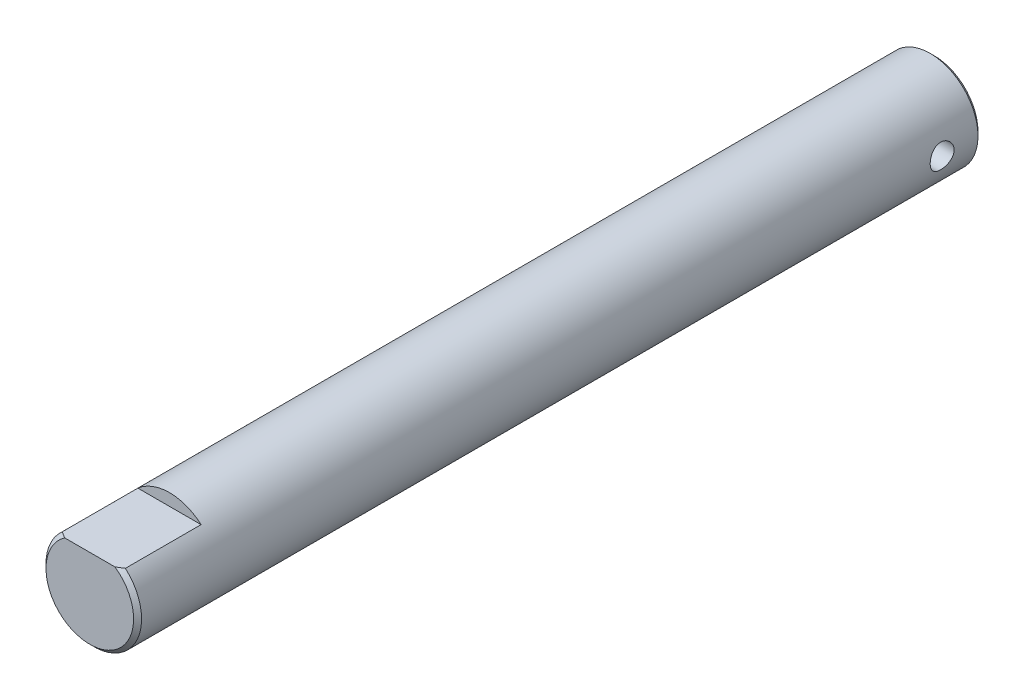
ISO-10303-21;
HEADER;
FILE_DESCRIPTION(('STEP AP214'),'2;1');
FILE_NAME('part.step','',(''),(''),'','','');
FILE_SCHEMA(('AUTOMOTIVE_DESIGN { 1 0 10303 214 1 1 1 1 }'));
ENDSEC;
DATA;
#1=APPLICATION_CONTEXT('core data for automotive mechanical design processes');
#2=APPLICATION_PROTOCOL_DEFINITION('international standard','automotive_design',2000,#1);
#3=PRODUCT_CONTEXT('',#1,'mechanical');
#4=PRODUCT('Part','Part','',(#3));
#5=PRODUCT_RELATED_PRODUCT_CATEGORY('part','',(#4));
#6=PRODUCT_DEFINITION_FORMATION('','',#4);
#7=PRODUCT_DEFINITION_CONTEXT('part definition',#1,'design');
#8=PRODUCT_DEFINITION('design','',#6,#7);
#9=PRODUCT_DEFINITION_SHAPE('','',#8);
#10=(LENGTH_UNIT() NAMED_UNIT(*) SI_UNIT(.MILLI.,.METRE.));
#11=(NAMED_UNIT(*) PLANE_ANGLE_UNIT() SI_UNIT($,.RADIAN.));
#12=(NAMED_UNIT(*) SI_UNIT($,.STERADIAN.) SOLID_ANGLE_UNIT());
#13=UNCERTAINTY_MEASURE_WITH_UNIT(LENGTH_MEASURE(1.E-05),#10,'distance_accuracy_value','');
#14=(GEOMETRIC_REPRESENTATION_CONTEXT(3) GLOBAL_UNCERTAINTY_ASSIGNED_CONTEXT((#13)) GLOBAL_UNIT_ASSIGNED_CONTEXT((#10,
#11,#12)) REPRESENTATION_CONTEXT('',''));
#15=CARTESIAN_POINT('',(0.,0.,0.));
#16=DIRECTION('',(0.,0.,1.));
#17=DIRECTION('',(1.,0.,0.));
#18=AXIS2_PLACEMENT_3D('',#15,#16,#17);
#19=CARTESIAN_POINT('',(0.,0.,106.));
#20=DIRECTION('',(0.,0.,-1.));
#21=DIRECTION('',(-1.,0.,0.));
#22=AXIS2_PLACEMENT_3D('',#19,#20,#21);
#23=CYLINDRICAL_SURFACE('',#22,6.);
#24=CARTESIAN_POINT('',(-6.,0.,3.5));
#25=CARTESIAN_POINT('',(-5.99999859868013,0.0828760886697311,3.50000232573816));
#26=CARTESIAN_POINT('',(-5.99826578131828,0.165778157830763,3.50689155077379));
#27=CARTESIAN_POINT('',(-5.99152113829892,0.329206323770532,3.53422515130701));
#28=CARTESIAN_POINT('',(-5.98650745419968,0.409731046870739,3.55467720953785));
#29=CARTESIAN_POINT('',(-5.9737562633204,0.566020872182577,3.60843925346209));
#30=CARTESIAN_POINT('',(-5.96602202842087,0.641791563430003,3.64173379871528));
#31=CARTESIAN_POINT('',(-5.94865343807593,0.786672131904426,3.72018139004483));
#32=CARTESIAN_POINT('',(-5.9390190185405,0.855781784348759,3.76533483611894));
#33=CARTESIAN_POINT('',(-5.91867413591801,0.986801927300919,3.86720078965421));
#34=CARTESIAN_POINT('',(-5.90794707148533,1.04855569006107,3.92411157495918));
#35=CARTESIAN_POINT('',(-5.8867362011753,1.1617489272033,4.04745220490892));
#36=CARTESIAN_POINT('',(-5.87625242288348,1.21318723694913,4.1138831229465));
#37=CARTESIAN_POINT('',(-5.8565477569971,1.30502654279903,4.25559522673744));
#38=CARTESIAN_POINT('',(-5.84734794470605,1.34525221592536,4.3309932308104));
#39=CARTESIAN_POINT('',(-5.83149494812223,1.41239690855053,4.48774841165836));
#40=CARTESIAN_POINT('',(-5.82484135672789,1.43931805543933,4.56910463332576));
#41=CARTESIAN_POINT('',(-5.81500476717551,1.47855483680429,4.73374349820247));
#42=CARTESIAN_POINT('',(-5.81175491075426,1.49115226833334,4.8169548960498));
#43=CARTESIAN_POINT('',(-5.80889362537741,1.50226177506785,4.98436856901398));
#44=CARTESIAN_POINT('',(-5.80928160448644,1.50077614181798,5.06857068069861));
#45=CARTESIAN_POINT('',(-5.81359205496618,1.48398652463928,5.23341580774448));
#46=CARTESIAN_POINT('',(-5.81742863001879,1.46901834019052,5.3140956214651));
#47=CARTESIAN_POINT('',(-5.82806709676484,1.42622418690311,5.47176105091129));
#48=CARTESIAN_POINT('',(-5.83486919970697,1.39839730206942,5.54874640302898));
#49=CARTESIAN_POINT('',(-5.85075113904187,1.33038947793715,5.69773801625207));
#50=CARTESIAN_POINT('',(-5.85985327469421,1.29008666723291,5.76968617178955));
#51=CARTESIAN_POINT('',(-5.87929710846386,1.19835627601495,5.90591870975684));
#52=CARTESIAN_POINT('',(-5.88963902334735,1.14692674880884,5.97020174806725));
#53=CARTESIAN_POINT('',(-5.91075880539781,1.03266342468122,6.0912036156944));
#54=CARTESIAN_POINT('',(-5.92154069477971,0.96954625816586,6.14765449006135));
#55=CARTESIAN_POINT('',(-5.94205965578786,0.8346119175037,6.2492212424639));
#56=CARTESIAN_POINT('',(-5.95179669549415,0.762794477707944,6.29433677426356));
#57=CARTESIAN_POINT('',(-5.96917732094183,0.612115888681392,6.37205058622438));
#58=CARTESIAN_POINT('',(-5.97681360127725,0.533231393208623,6.40460534025443));
#59=CARTESIAN_POINT('',(-5.98907916991419,0.370876008142883,6.45591730570957));
#60=CARTESIAN_POINT('',(-5.99370903339281,0.287405999150485,6.47467715641814));
#61=CARTESIAN_POINT('',(-5.99935499271375,0.120539970390027,6.49745756555884));
#62=CARTESIAN_POINT('',(-6.00046053508279,0.0371967199882104,6.5018430260753));
#63=CARTESIAN_POINT('',(-5.99918804814451,-0.129032874801507,6.49675099794451));
#64=CARTESIAN_POINT('',(-5.99681033241847,-0.211919259644595,6.48727475720087));
#65=CARTESIAN_POINT('',(-5.98889581127357,-0.373614268776491,6.45502909160862));
#66=CARTESIAN_POINT('',(-5.98340634185811,-0.452465118968754,6.43245873652301));
#67=CARTESIAN_POINT('',(-5.96988706634134,-0.605257292452511,6.37489291597155));
#68=CARTESIAN_POINT('',(-5.96185700369892,-0.679198119032634,6.33989619568683));
#69=CARTESIAN_POINT('',(-5.94393307926311,-0.821523134429846,6.25776387112527));
#70=CARTESIAN_POINT('',(-5.93400867366932,-0.889785441835829,6.21042388760324));
#71=CARTESIAN_POINT('',(-5.91344509187419,-1.01752661364324,6.10521009120303));
#72=CARTESIAN_POINT('',(-5.90280579251705,-1.07700395897301,6.04733446038309));
#73=CARTESIAN_POINT('',(-5.88168956960771,-1.18699056807273,5.92099803915554));
#74=CARTESIAN_POINT('',(-5.87122304187281,-1.23724386762203,5.85231229699758));
#75=CARTESIAN_POINT('',(-5.85192878377239,-1.3255107590127,5.70726736553428));
#76=CARTESIAN_POINT('',(-5.84310098067026,-1.36352489415794,5.63090851704025));
#77=CARTESIAN_POINT('',(-5.82818094734665,-1.42595142060929,5.47309427758692));
#78=CARTESIAN_POINT('',(-5.82207255291906,-1.45044439665406,5.39167237165599));
#79=CARTESIAN_POINT('',(-5.81326744090184,-1.48534565995378,5.22569036211089));
#80=CARTESIAN_POINT('',(-5.81056997719936,-1.49575702747866,5.14113094896751));
#81=CARTESIAN_POINT('',(-5.80894901203957,-1.50203859033399,4.9738789761448));
#82=CARTESIAN_POINT('',(-5.80991932728264,-1.49831789778012,4.89120256487527));
#83=CARTESIAN_POINT('',(-5.81527909007843,-1.47737727831287,4.72769611133202));
#84=CARTESIAN_POINT('',(-5.81966846891857,-1.46015762268677,4.64686603198635));
#85=CARTESIAN_POINT('',(-5.83131260682723,-1.41293131944279,4.48979154093459));
#86=CARTESIAN_POINT('',(-5.8385501523631,-1.38300140468038,4.41352269475979));
#87=CARTESIAN_POINT('',(-5.85507755724829,-1.31126491360507,4.26703461728631));
#88=CARTESIAN_POINT('',(-5.86436770120773,-1.26945669003419,4.19681622681308));
#89=CARTESIAN_POINT('',(-5.88425634263512,-1.17386774863714,4.06244537099798));
#90=CARTESIAN_POINT('',(-5.89488264831757,-1.11980316291225,3.99849892657604));
#91=CARTESIAN_POINT('',(-5.91608027246286,-1.00178937118974,3.88045295520459));
#92=CARTESIAN_POINT('',(-5.9266515772706,-0.937837821261145,3.82635576988703));
#93=CARTESIAN_POINT('',(-5.94677655647663,-0.80046758670259,3.72858869143539));
#94=CARTESIAN_POINT('',(-5.95630833365868,-0.726898422316387,3.68512538632842));
#95=CARTESIAN_POINT('',(-5.97304924975118,-0.573266059510477,3.61125253705947));
#96=CARTESIAN_POINT('',(-5.98026005199781,-0.49320756343674,3.58083363935146));
#97=CARTESIAN_POINT('',(-5.99048059565542,-0.344410253243472,3.53842816967035));
#98=CARTESIAN_POINT('',(-5.99402585052691,-0.276380170908068,3.52404875694657));
#99=CARTESIAN_POINT('',(-5.99878605231948,-0.138906071536283,3.50483405637806));
#100=CARTESIAN_POINT('',(-6.00000117450894,-0.0694621612426163,3.4999980506947));
#101=CARTESIAN_POINT('',(-6.,0.,3.5));
#102=B_SPLINE_CURVE_WITH_KNOTS('',3,(#24,#25,#26,#27,#28,#29,#30,#31,#32,#33,#34,#35,#36,#37,
#38,#39,#40,#41,#42,#43,#44,#45,#46,#47,#48,#49,#50,#51,#52,#53,#54,#55,#56,#57,#58,#59,#60,#61,
#62,#63,#64,#65,#66,#67,#68,#69,#70,#71,#72,#73,#74,#75,#76,#77,#78,#79,#80,#81,#82,#83,#84,#85,
#86,#87,#88,#89,#90,#91,#92,#93,#94,#95,#96,#97,#98,#99,#100,#101),.UNSPECIFIED.,.T.,.F.,(4,2,2,
2,2,2,2,2,2,2,2,2,2,2,2,2,2,2,2,2,2,2,2,2,2,2,2,2,2,2,2,2,2,2,2,2,2,2,4),(0.,0.24837371247189,
0.496888237763899,0.745104902286106,0.993329940169328,1.24614435437139,1.49898729580062,
1.75558647545807,2.01214461169368,2.2635629509943,2.51494038112697,2.76022497007018,
3.00552703466038,3.25330527873879,3.50112690836162,3.75601500969019,4.01091089558247,
4.26668229009114,4.52240473688642,4.77158308949276,5.02073901112743,5.26620274514037,
5.5116912732229,5.76153587565352,6.01142363008019,6.26744509204476,6.52345518749508,
6.77792254614036,7.03233423252407,7.27943780398612,7.52653640956034,7.77216400559447,
8.01782568136901,8.2698957640991,8.52202569770417,8.77872185499587,9.0352336382135,
9.24342242942149,9.45159556043039),.UNSPECIFIED.);
#103=CARTESIAN_POINT('',(-6.,0.,3.5));
#104=VERTEX_POINT('',#103);
#105=EDGE_CURVE('E11',#104,#104,#102,.T.);
#106=ORIENTED_EDGE('',*,*,#105,.T.);
#107=EDGE_LOOP('',(#106));
#108=FACE_BOUND('',#107,.T.);
#109=CARTESIAN_POINT('',(6.,0.,3.5));
#110=CARTESIAN_POINT('',(5.99999859868012,-0.0828760886697311,3.50000232573816));
#111=CARTESIAN_POINT('',(5.99826578131828,-0.165778157830763,3.50689155077379));
#112=CARTESIAN_POINT('',(5.99152113829892,-0.329206323770533,3.53422515130701));
#113=CARTESIAN_POINT('',(5.98650745419968,-0.409731046870739,3.55467720953785));
#114=CARTESIAN_POINT('',(5.9737562633204,-0.566020872182577,3.60843925346209));
#115=CARTESIAN_POINT('',(5.96602202842087,-0.641791563430003,3.64173379871528));
#116=CARTESIAN_POINT('',(5.94865343807593,-0.786672131904426,3.72018139004483));
#117=CARTESIAN_POINT('',(5.9390190185405,-0.855781784348759,3.76533483611894));
#118=CARTESIAN_POINT('',(5.91867413591801,-0.986801927300919,3.86720078965421));
#119=CARTESIAN_POINT('',(5.90794707148533,-1.04855569006107,3.92411157495918));
#120=CARTESIAN_POINT('',(5.8867362011753,-1.1617489272033,4.04745220490892));
#121=CARTESIAN_POINT('',(5.87625242288348,-1.21318723694913,4.1138831229465));
#122=CARTESIAN_POINT('',(5.8565477569971,-1.30502654279903,4.25559522673744));
#123=CARTESIAN_POINT('',(5.84734794470605,-1.34525221592536,4.3309932308104));
#124=CARTESIAN_POINT('',(5.83149494812223,-1.41239690855053,4.48774841165836));
#125=CARTESIAN_POINT('',(5.82484135672789,-1.43931805543933,4.56910463332576));
#126=CARTESIAN_POINT('',(5.81500476717551,-1.47855483680429,4.73374349820247));
#127=CARTESIAN_POINT('',(5.81175491075426,-1.49115226833334,4.8169548960498));
#128=CARTESIAN_POINT('',(5.80889362537741,-1.50226177506785,4.98436856901398));
#129=CARTESIAN_POINT('',(5.80928160448644,-1.50077614181798,5.06857068069861));
#130=CARTESIAN_POINT('',(5.81359205496618,-1.48398652463928,5.23341580774448));
#131=CARTESIAN_POINT('',(5.81742863001879,-1.46901834019052,5.3140956214651));
#132=CARTESIAN_POINT('',(5.82806709676484,-1.42622418690311,5.47176105091129));
#133=CARTESIAN_POINT('',(5.83486919970696,-1.39839730206942,5.54874640302898));
#134=CARTESIAN_POINT('',(5.85075113904187,-1.33038947793715,5.69773801625207));
#135=CARTESIAN_POINT('',(5.85985327469421,-1.29008666723291,5.76968617178955));
#136=CARTESIAN_POINT('',(5.87929710846386,-1.19835627601495,5.90591870975684));
#137=CARTESIAN_POINT('',(5.88963902334735,-1.14692674880884,5.97020174806725));
#138=CARTESIAN_POINT('',(5.91075880539781,-1.03266342468122,6.0912036156944));
#139=CARTESIAN_POINT('',(5.92154069477971,-0.96954625816586,6.14765449006135));
#140=CARTESIAN_POINT('',(5.94205965578786,-0.8346119175037,6.2492212424639));
#141=CARTESIAN_POINT('',(5.95179669549415,-0.762794477707944,6.29433677426356));
#142=CARTESIAN_POINT('',(5.96917732094183,-0.612115888681392,6.37205058622438));
#143=CARTESIAN_POINT('',(5.97681360127725,-0.533231393208623,6.40460534025443));
#144=CARTESIAN_POINT('',(5.98907916991419,-0.370876008142883,6.45591730570957));
#145=CARTESIAN_POINT('',(5.99370903339281,-0.287405999150485,6.47467715641814));
#146=CARTESIAN_POINT('',(5.99935499271375,-0.120539970390028,6.49745756555884));
#147=CARTESIAN_POINT('',(6.00046053508279,-0.0371967199882106,6.5018430260753));
#148=CARTESIAN_POINT('',(5.99918804814451,0.129032874801507,6.49675099794451));
#149=CARTESIAN_POINT('',(5.99681033241847,0.211919259644594,6.48727475720087));
#150=CARTESIAN_POINT('',(5.98889581127357,0.373614268776491,6.45502909160862));
#151=CARTESIAN_POINT('',(5.98340634185811,0.452465118968754,6.43245873652301));
#152=CARTESIAN_POINT('',(5.96988706634134,0.605257292452511,6.37489291597155));
#153=CARTESIAN_POINT('',(5.96185700369892,0.679198119032634,6.33989619568683));
#154=CARTESIAN_POINT('',(5.94393307926311,0.821523134429847,6.25776387112527));
#155=CARTESIAN_POINT('',(5.93400867366932,0.88978544183583,6.21042388760324));
#156=CARTESIAN_POINT('',(5.91344509187419,1.01752661364325,6.10521009120303));
#157=CARTESIAN_POINT('',(5.90280579251705,1.07700395897301,6.04733446038309));
#158=CARTESIAN_POINT('',(5.88168956960771,1.18699056807273,5.92099803915553));
#159=CARTESIAN_POINT('',(5.87122304187281,1.23724386762203,5.85231229699758));
#160=CARTESIAN_POINT('',(5.85192878377239,1.3255107590127,5.70726736553428));
#161=CARTESIAN_POINT('',(5.84310098067026,1.36352489415794,5.63090851704025));
#162=CARTESIAN_POINT('',(5.82818094734665,1.42595142060929,5.47309427758692));
#163=CARTESIAN_POINT('',(5.82207255291906,1.45044439665406,5.39167237165599));
#164=CARTESIAN_POINT('',(5.81326744090184,1.48534565995378,5.22569036211089));
#165=CARTESIAN_POINT('',(5.81056997719936,1.49575702747866,5.14113094896751));
#166=CARTESIAN_POINT('',(5.80894901203957,1.50203859033399,4.9738789761448));
#167=CARTESIAN_POINT('',(5.80991932728264,1.49831789778012,4.89120256487527));
#168=CARTESIAN_POINT('',(5.81527909007843,1.47737727831287,4.72769611133202));
#169=CARTESIAN_POINT('',(5.81966846891857,1.46015762268677,4.64686603198635));
#170=CARTESIAN_POINT('',(5.83131260682723,1.41293131944279,4.48979154093459));
#171=CARTESIAN_POINT('',(5.8385501523631,1.38300140468038,4.41352269475979));
#172=CARTESIAN_POINT('',(5.85507755724829,1.31126491360507,4.26703461728631));
#173=CARTESIAN_POINT('',(5.86436770120773,1.26945669003419,4.19681622681309));
#174=CARTESIAN_POINT('',(5.88425634263512,1.17386774863714,4.06244537099798));
#175=CARTESIAN_POINT('',(5.89488264831757,1.11980316291225,3.99849892657604));
#176=CARTESIAN_POINT('',(5.91608027246286,1.00178937118974,3.88045295520459));
#177=CARTESIAN_POINT('',(5.9266515772706,0.937837821261146,3.82635576988703));
#178=CARTESIAN_POINT('',(5.94677655647663,0.80046758670259,3.72858869143539));
#179=CARTESIAN_POINT('',(5.95630833365868,0.726898422316387,3.68512538632842));
#180=CARTESIAN_POINT('',(5.97304924975118,0.573266059510477,3.61125253705947));
#181=CARTESIAN_POINT('',(5.98026005199781,0.49320756343674,3.58083363935146));
#182=CARTESIAN_POINT('',(5.99048059565542,0.344410253243473,3.53842816967035));
#183=CARTESIAN_POINT('',(5.99402585052691,0.27638017090807,3.52404875694657));
#184=CARTESIAN_POINT('',(5.99878605231948,0.138906071536284,3.50483405637806));
#185=CARTESIAN_POINT('',(6.00000117450894,0.0694621612426168,3.4999980506947));
#186=CARTESIAN_POINT('',(6.,0.,3.5));
#187=B_SPLINE_CURVE_WITH_KNOTS('',3,(#109,#110,#111,#112,#113,#114,#115,#116,#117,#118,#119,
#120,#121,#122,#123,#124,#125,#126,#127,#128,#129,#130,#131,#132,#133,#134,#135,#136,#137,#138,
#139,#140,#141,#142,#143,#144,#145,#146,#147,#148,#149,#150,#151,#152,#153,#154,#155,#156,#157,
#158,#159,#160,#161,#162,#163,#164,#165,#166,#167,#168,#169,#170,#171,#172,#173,#174,#175,#176,
#177,#178,#179,#180,#181,#182,#183,#184,#185,#186),.UNSPECIFIED.,.T.,.F.,(4,2,2,2,2,2,2,2,2,2,2,
2,2,2,2,2,2,2,2,2,2,2,2,2,2,2,2,2,2,2,2,2,2,2,2,2,2,2,4),(0.,0.24837371247189,0.4968882377639,
0.745104902286106,0.993329940169328,1.24614435437139,1.49898729580062,1.75558647545807,
2.01214461169368,2.2635629509943,2.51494038112697,2.76022497007018,3.00552703466038,
3.25330527873879,3.50112690836162,3.75601500969019,4.01091089558247,4.26668229009114,
4.52240473688642,4.77158308949276,5.02073901112743,5.26620274514037,5.5116912732229,
5.76153587565352,6.01142363008019,6.26744509204476,6.52345518749508,6.77792254614036,
7.03233423252407,7.27943780398612,7.52653640956034,7.77216400559447,8.01782568136901,
8.2698957640991,8.52202569770417,8.77872185499587,9.03523363821349,9.24342242942148,
9.45159556043039),.UNSPECIFIED.);
#188=CARTESIAN_POINT('',(6.,0.,3.5));
#189=VERTEX_POINT('',#188);
#190=EDGE_CURVE('E57',#189,#189,#187,.T.);
#191=ORIENTED_EDGE('',*,*,#190,.T.);
#192=EDGE_LOOP('',(#191));
#193=FACE_BOUND('',#192,.T.);
#194=CARTESIAN_POINT('',(0.,0.,105.5));
#195=DIRECTION('',(0.,0.,1.));
#196=DIRECTION('',(1.,0.,0.));
#197=AXIS2_PLACEMENT_3D('',#194,#195,#196);
#198=CIRCLE('',#197,6.);
#199=CARTESIAN_POINT('',(3.96862696659689,4.5,105.5));
#200=VERTEX_POINT('',#199);
#201=CARTESIAN_POINT('',(-3.96862696659689,4.5,105.5));
#202=VERTEX_POINT('',#201);
#203=EDGE_CURVE('E148',#200,#202,#198,.F.);
#204=ORIENTED_EDGE('',*,*,#203,.T.);
#205=DIRECTION('',(0.,0.,-1.));
#206=VECTOR('',#205,1.);
#207=CARTESIAN_POINT('',(-3.96862696659689,4.5,106.));
#208=LINE('',#207,#206);
#209=CARTESIAN_POINT('',(-3.96862696659689,4.5,96.));
#210=VERTEX_POINT('',#209);
#211=EDGE_CURVE('E70',#202,#210,#208,.T.);
#212=ORIENTED_EDGE('',*,*,#211,.T.);
#213=CARTESIAN_POINT('',(0.,0.,96.));
#214=DIRECTION('',(0.,0.,1.));
#215=DIRECTION('',(1.,0.,0.));
#216=AXIS2_PLACEMENT_3D('',#213,#214,#215);
#217=CIRCLE('',#216,6.);
#218=CARTESIAN_POINT('',(3.96862696659689,4.5,96.));
#219=VERTEX_POINT('',#218);
#220=EDGE_CURVE('E88',#219,#210,#217,.T.);
#221=ORIENTED_EDGE('',*,*,#220,.F.);
#222=DIRECTION('',(0.,0.,-1.));
#223=VECTOR('',#222,1.);
#224=CARTESIAN_POINT('',(3.96862696659689,4.5,106.));
#225=LINE('',#224,#223);
#226=EDGE_CURVE('E158',#219,#200,#225,.F.);
#227=ORIENTED_EDGE('',*,*,#226,.T.);
#228=EDGE_LOOP('',(#204,#212,#221,#227));
#229=FACE_BOUND('',#228,.T.);
#230=CARTESIAN_POINT('',(0.,0.,0.499999999999987));
#231=DIRECTION('',(0.,0.,1.));
#232=DIRECTION('',(1.,0.,0.));
#233=AXIS2_PLACEMENT_3D('',#230,#231,#232);
#234=CIRCLE('',#233,6.);
#235=CARTESIAN_POINT('',(6.,0.,0.499999999999987));
#236=VERTEX_POINT('',#235);
#237=EDGE_CURVE('E104',#236,#236,#234,.T.);
#238=ORIENTED_EDGE('',*,*,#237,.T.);
#239=EDGE_LOOP('',(#238));
#240=FACE_BOUND('',#239,.T.);
#241=ADVANCED_FACE('F41',(#108,#193,#229,#240),#23,.T.);
#242=CARTESIAN_POINT('',(0.,0.,106.));
#243=DIRECTION('',(0.,0.,1.));
#244=DIRECTION('',(1.,0.,0.));
#245=AXIS2_PLACEMENT_3D('',#242,#243,#244);
#246=PLANE('',#245);
#247=DIRECTION('',(1.,0.,0.));
#248=VECTOR('',#247,1.);
#249=CARTESIAN_POINT('',(-10.,4.5,106.));
#250=LINE('',#249,#248);
#251=CARTESIAN_POINT('',(-3.16227766016844,4.5,106.));
#252=VERTEX_POINT('',#251);
#253=CARTESIAN_POINT('',(3.16227766016844,4.5,106.));
#254=VERTEX_POINT('',#253);
#255=EDGE_CURVE('E64',#252,#254,#250,.T.);
#256=ORIENTED_EDGE('',*,*,#255,.F.);
#257=CARTESIAN_POINT('',(0.,0.,106.));
#258=DIRECTION('',(0.,0.,1.));
#259=DIRECTION('',(1.,0.,0.));
#260=AXIS2_PLACEMENT_3D('',#257,#258,#259);
#261=CIRCLE('',#260,5.50000000000003);
#262=EDGE_CURVE('E94',#252,#254,#261,.T.);
#263=ORIENTED_EDGE('',*,*,#262,.T.);
#264=EDGE_LOOP('',(#256,#263));
#265=FACE_BOUND('',#264,.T.);
#266=ADVANCED_FACE('F93',(#265),#246,.T.);
#267=CARTESIAN_POINT('',(0.,0.,0.));
#268=DIRECTION('',(0.,0.,1.));
#269=DIRECTION('',(1.,0.,0.));
#270=AXIS2_PLACEMENT_3D('',#267,#268,#269);
#271=PLANE('',#270);
#272=CARTESIAN_POINT('',(0.,0.,0.));
#273=DIRECTION('',(0.,0.,1.));
#274=DIRECTION('',(1.,0.,0.));
#275=AXIS2_PLACEMENT_3D('',#272,#273,#274);
#276=CIRCLE('',#275,5.49999999999999);
#277=CARTESIAN_POINT('',(5.49999999999999,0.,0.));
#278=VERTEX_POINT('',#277);
#279=EDGE_CURVE('E99',#278,#278,#276,.F.);
#280=ORIENTED_EDGE('',*,*,#279,.T.);
#281=EDGE_LOOP('',(#280));
#282=FACE_BOUND('',#281,.T.);
#283=ADVANCED_FACE('F121',(#282),#271,.F.);
#284=CARTESIAN_POINT('',(0.,0.,0.499999999999987));
#285=DIRECTION('',(0.,0.,1.));
#286=DIRECTION('',(1.,0.,0.));
#287=AXIS2_PLACEMENT_3D('',#284,#285,#286);
#288=CONICAL_SURFACE('',#287,6.,0.785398163397471);
#289=ORIENTED_EDGE('',*,*,#279,.F.);
#290=EDGE_LOOP('',(#289));
#291=FACE_BOUND('',#290,.T.);
#292=ORIENTED_EDGE('',*,*,#237,.F.);
#293=EDGE_LOOP('',(#292));
#294=FACE_BOUND('',#293,.T.);
#295=ADVANCED_FACE('F123',(#291,#294),#288,.T.);
#296=CARTESIAN_POINT('',(0.,0.,106.));
#297=DIRECTION('',(0.,0.,-1.));
#298=DIRECTION('',(-1.,0.,0.));
#299=AXIS2_PLACEMENT_3D('',#296,#297,#298);
#300=CONICAL_SURFACE('',#299,5.50000000000003,0.785398163397458);
#301=CARTESIAN_POINT('',(-3.96968518776994,4.5,105.4993));
#302=CARTESIAN_POINT('',(-3.87339264212718,4.5,105.562990010043));
#303=CARTESIAN_POINT('',(-3.77650441507859,4.5,105.625792326843));
#304=CARTESIAN_POINT('',(-3.58137101964479,4.5,105.749306344929));
#305=CARTESIAN_POINT('',(-3.48312550860662,4.5,105.810017504262));
#306=CARTESIAN_POINT('',(-3.28464161125408,4.5,105.929313258901));
#307=CARTESIAN_POINT('',(-3.18439546930276,4.5,105.987885013709));
#308=CARTESIAN_POINT('',(-2.98227588858379,4.5,106.102127102068));
#309=CARTESIAN_POINT('',(-2.88040255787624,4.5,106.157797627248));
#310=CARTESIAN_POINT('',(-2.56614314186694,4.5,106.322877952429));
#311=CARTESIAN_POINT('',(-2.35083682891523,4.5,106.42684727166));
#312=CARTESIAN_POINT('',(-1.91191588938556,4.5,106.614685979017));
#313=CARTESIAN_POINT('',(-1.6883203219207,4.5,106.698598528884));
#314=CARTESIAN_POINT('',(-1.32682203176171,4.5,106.810192158096));
#315=CARTESIAN_POINT('',(-1.19167293079569,4.5,106.846783123179));
#316=CARTESIAN_POINT('',(-0.918838291994869,4.5,106.90906966792));
#317=CARTESIAN_POINT('',(-0.781152675434746,4.5,106.934764908813));
#318=CARTESIAN_POINT('',(-0.50568677670916,4.5,106.973703163724));
#319=CARTESIAN_POINT('',(-0.3679273056662,4.5,106.987091375502));
#320=CARTESIAN_POINT('',(-0.0917592093995029,4.5,107.001176732634));
#321=CARTESIAN_POINT('',(0.0466493674345948,4.5,107.001874809432));
#322=CARTESIAN_POINT('',(0.323024452129258,4.5,106.990536239138));
#323=CARTESIAN_POINT('',(0.460990616515593,4.5,106.978491362303));
#324=CARTESIAN_POINT('',(0.735324495961169,4.5,106.942347341385));
#325=CARTESIAN_POINT('',(0.87169202390345,4.5,106.918246800351));
#326=CARTESIAN_POINT('',(1.14362252943251,4.5,106.858874582924));
#327=CARTESIAN_POINT('',(1.27915717091643,4.5,106.823474826622));
#328=CARTESIAN_POINT('',(1.54732429372732,4.5,106.743127192322));
#329=CARTESIAN_POINT('',(1.67995678272891,4.5,106.698179339578));
#330=CARTESIAN_POINT('',(2.00507503766925,4.5,106.576799586627));
#331=CARTESIAN_POINT('',(2.19577611276905,4.5,106.495603685789));
#332=CARTESIAN_POINT('',(2.57108474811635,4.5,106.319949230993));
#333=CARTESIAN_POINT('',(2.75568555310619,4.5,106.225476545011));
#334=CARTESIAN_POINT('',(3.11446237166643,4.5,106.029356228701));
#335=CARTESIAN_POINT('',(3.28878541271141,4.5,105.927975313206));
#336=CARTESIAN_POINT('',(3.5467416790105,4.5,105.770709876554));
#337=CARTESIAN_POINT('',(3.63202566750181,4.5,105.717498124036));
#338=CARTESIAN_POINT('',(3.8015845938077,4.5,105.609517616878));
#339=CARTESIAN_POINT('',(3.88585968471013,4.5,105.554749102824));
#340=CARTESIAN_POINT('',(3.96968518776995,4.5,105.4993));
#341=B_SPLINE_CURVE_WITH_KNOTS('',3,(#301,#302,#303,#304,#305,#306,#307,#308,#309,#310,#311,
#312,#313,#314,#315,#316,#317,#318,#319,#320,#321,#322,#323,#324,#325,#326,#327,#328,#329,#330,
#331,#332,#333,#334,#335,#336,#337,#338,#339,#340),.UNSPECIFIED.,.F.,.F.,(4,2,2,2,2,2,2,2,2,2,2,
2,2,2,2,2,2,2,2,4),(0.,0.346354756881328,0.692798611306206,1.04106163248063,1.38930162120577,
2.10587648536807,2.82089512487663,3.24056561164751,3.6602491456631,4.07491522819882,
4.48955087453129,4.90445446735077,5.31940614836471,5.7392392422665,6.15907122580611,
6.78014680302663,7.4018885418643,8.00663509482275,8.30819079976048,8.60970015206716),.UNSPECIFIED.);
#342=EDGE_CURVE('E81',#202,#252,#341,.T.);
#343=ORIENTED_EDGE('',*,*,#342,.F.);
#344=ORIENTED_EDGE('',*,*,#203,.F.);
#345=EDGE_CURVE('E89',#254,#200,#341,.T.);
#346=ORIENTED_EDGE('',*,*,#345,.F.);
#347=ORIENTED_EDGE('',*,*,#262,.F.);
#348=EDGE_LOOP('',(#343,#344,#346,#347));
#349=FACE_BOUND('',#348,.T.);
#350=ADVANCED_FACE('F44',(#349),#300,.T.);
#351=CARTESIAN_POINT('',(0.,0.,96.));
#352=DIRECTION('',(0.,0.,1.));
#353=DIRECTION('',(1.,0.,0.));
#354=AXIS2_PLACEMENT_3D('',#351,#352,#353);
#355=PLANE('',#354);
#356=ORIENTED_EDGE('',*,*,#220,.T.);
#357=DIRECTION('',(1.,0.,0.));
#358=VECTOR('',#357,1.);
#359=CARTESIAN_POINT('',(-10.,4.5,96.));
#360=LINE('',#359,#358);
#361=EDGE_CURVE('E96',#210,#219,#360,.T.);
#362=ORIENTED_EDGE('',*,*,#361,.T.);
#363=EDGE_LOOP('',(#356,#362));
#364=FACE_BOUND('',#363,.T.);
#365=ADVANCED_FACE('F118',(#364),#355,.T.);
#366=CARTESIAN_POINT('',(-10.,4.5,96.));
#367=DIRECTION('',(0.,-1.,0.));
#368=DIRECTION('',(0.,0.,-1.));
#369=AXIS2_PLACEMENT_3D('',#366,#367,#368);
#370=PLANE('',#369);
#371=ORIENTED_EDGE('',*,*,#342,.T.);
#372=ORIENTED_EDGE('',*,*,#255,.T.);
#373=ORIENTED_EDGE('',*,*,#345,.T.);
#374=ORIENTED_EDGE('',*,*,#226,.F.);
#375=ORIENTED_EDGE('',*,*,#361,.F.);
#376=ORIENTED_EDGE('',*,*,#211,.F.);
#377=EDGE_LOOP('',(#371,#372,#373,#374,#375,#376));
#378=FACE_BOUND('',#377,.T.);
#379=ADVANCED_FACE('F82',(#378),#370,.F.);
#380=CARTESIAN_POINT('',(-6.,0.,5.));
#381=DIRECTION('',(1.,0.,0.));
#382=DIRECTION('',(0.,0.,-1.));
#383=AXIS2_PLACEMENT_3D('',#380,#381,#382);
#384=CYLINDRICAL_SURFACE('',#383,1.5);
#385=ORIENTED_EDGE('',*,*,#190,.F.);
#386=EDGE_LOOP('',(#385));
#387=FACE_BOUND('',#386,.T.);
#388=ORIENTED_EDGE('',*,*,#105,.F.);
#389=EDGE_LOOP('',(#388));
#390=FACE_BOUND('',#389,.T.);
#391=ADVANCED_FACE('F117',(#387,#390),#384,.F.);
#392=CLOSED_SHELL('',(#241,#266,#283,#295,#350,#365,#379,#391));
#393=MANIFOLD_SOLID_BREP('B2',#392);
#394=ADVANCED_BREP_SHAPE_REPRESENTATION('',(#18,#393),#14);
#395=SHAPE_DEFINITION_REPRESENTATION(#9,#394);
ENDSEC;
END-ISO-10303-21;
